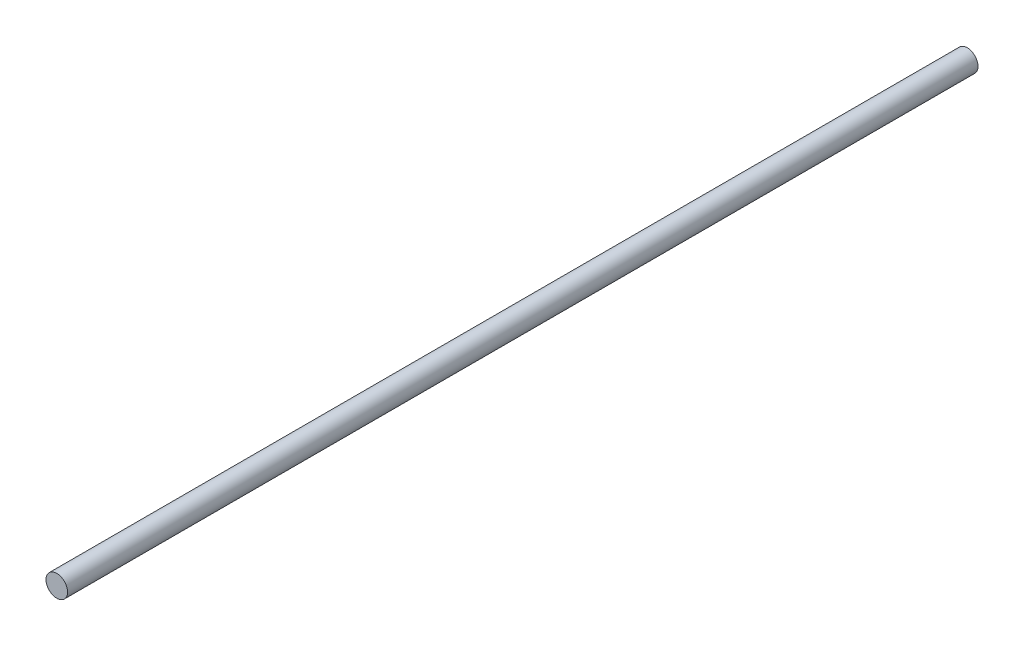
ISO-10303-21;
HEADER;
FILE_DESCRIPTION(('STEP AP214'),'2;1');
FILE_NAME('part.step','',(''),(''),'','','');
FILE_SCHEMA(('AUTOMOTIVE_DESIGN { 1 0 10303 214 1 1 1 1 }'));
ENDSEC;
DATA;
#1=APPLICATION_CONTEXT('core data for automotive mechanical design processes');
#2=APPLICATION_PROTOCOL_DEFINITION('international standard','automotive_design',2000,#1);
#3=PRODUCT_CONTEXT('',#1,'mechanical');
#4=PRODUCT('Part','Part','',(#3));
#5=PRODUCT_RELATED_PRODUCT_CATEGORY('part','',(#4));
#6=PRODUCT_DEFINITION_FORMATION('','',#4);
#7=PRODUCT_DEFINITION_CONTEXT('part definition',#1,'design');
#8=PRODUCT_DEFINITION('design','',#6,#7);
#9=PRODUCT_DEFINITION_SHAPE('','',#8);
#10=(LENGTH_UNIT() NAMED_UNIT(*) SI_UNIT(.MILLI.,.METRE.));
#11=(NAMED_UNIT(*) PLANE_ANGLE_UNIT() SI_UNIT($,.RADIAN.));
#12=(NAMED_UNIT(*) SI_UNIT($,.STERADIAN.) SOLID_ANGLE_UNIT());
#13=UNCERTAINTY_MEASURE_WITH_UNIT(LENGTH_MEASURE(1.E-05),#10,'distance_accuracy_value','');
#14=(GEOMETRIC_REPRESENTATION_CONTEXT(3) GLOBAL_UNCERTAINTY_ASSIGNED_CONTEXT((#13)) GLOBAL_UNIT_ASSIGNED_CONTEXT((#10,
#11,#12)) REPRESENTATION_CONTEXT('',''));
#15=CARTESIAN_POINT('',(0.,0.,0.));
#16=DIRECTION('',(0.,0.,1.));
#17=DIRECTION('',(1.,0.,0.));
#18=AXIS2_PLACEMENT_3D('',#15,#16,#17);
#19=CARTESIAN_POINT('',(0.,0.,268.));
#20=DIRECTION('',(0.,0.,-1.));
#21=DIRECTION('',(-1.,0.,0.));
#22=AXIS2_PLACEMENT_3D('',#19,#20,#21);
#23=CYLINDRICAL_SURFACE('',#22,6.35);
#24=CARTESIAN_POINT('',(0.,0.,268.));
#25=DIRECTION('',(0.,0.,1.));
#26=DIRECTION('',(1.,0.,0.));
#27=AXIS2_PLACEMENT_3D('',#24,#25,#26);
#28=CIRCLE('',#27,6.35);
#29=CARTESIAN_POINT('',(6.35,0.,268.));
#30=VERTEX_POINT('',#29);
#31=EDGE_CURVE('E10',#30,#30,#28,.T.);
#32=ORIENTED_EDGE('',*,*,#31,.F.);
#33=EDGE_LOOP('',(#32));
#34=FACE_BOUND('',#33,.T.);
#35=CARTESIAN_POINT('',(0.,0.,-268.));
#36=DIRECTION('',(0.,0.,1.));
#37=DIRECTION('',(1.,0.,0.));
#38=AXIS2_PLACEMENT_3D('',#35,#36,#37);
#39=CIRCLE('',#38,6.35);
#40=CARTESIAN_POINT('',(6.35,0.,-268.));
#41=VERTEX_POINT('',#40);
#42=EDGE_CURVE('E40',#41,#41,#39,.T.);
#43=ORIENTED_EDGE('',*,*,#42,.T.);
#44=EDGE_LOOP('',(#43));
#45=FACE_BOUND('',#44,.T.);
#46=ADVANCED_FACE('F37',(#34,#45),#23,.T.);
#47=CARTESIAN_POINT('',(0.,0.,268.));
#48=DIRECTION('',(0.,0.,1.));
#49=DIRECTION('',(1.,0.,0.));
#50=AXIS2_PLACEMENT_3D('',#47,#48,#49);
#51=PLANE('',#50);
#52=ORIENTED_EDGE('',*,*,#31,.T.);
#53=EDGE_LOOP('',(#52));
#54=FACE_BOUND('',#53,.T.);
#55=ADVANCED_FACE('F52',(#54),#51,.T.);
#56=CARTESIAN_POINT('',(0.,0.,-268.));
#57=DIRECTION('',(0.,0.,1.));
#58=DIRECTION('',(1.,0.,0.));
#59=AXIS2_PLACEMENT_3D('',#56,#57,#58);
#60=PLANE('',#59);
#61=ORIENTED_EDGE('',*,*,#42,.F.);
#62=EDGE_LOOP('',(#61));
#63=FACE_BOUND('',#62,.T.);
#64=ADVANCED_FACE('F50',(#63),#60,.F.);
#65=CLOSED_SHELL('',(#46,#55,#64));
#66=MANIFOLD_SOLID_BREP('B2',#65);
#67=ADVANCED_BREP_SHAPE_REPRESENTATION('',(#18,#66),#14);
#68=SHAPE_DEFINITION_REPRESENTATION(#9,#67);
ENDSEC;
END-ISO-10303-21;
